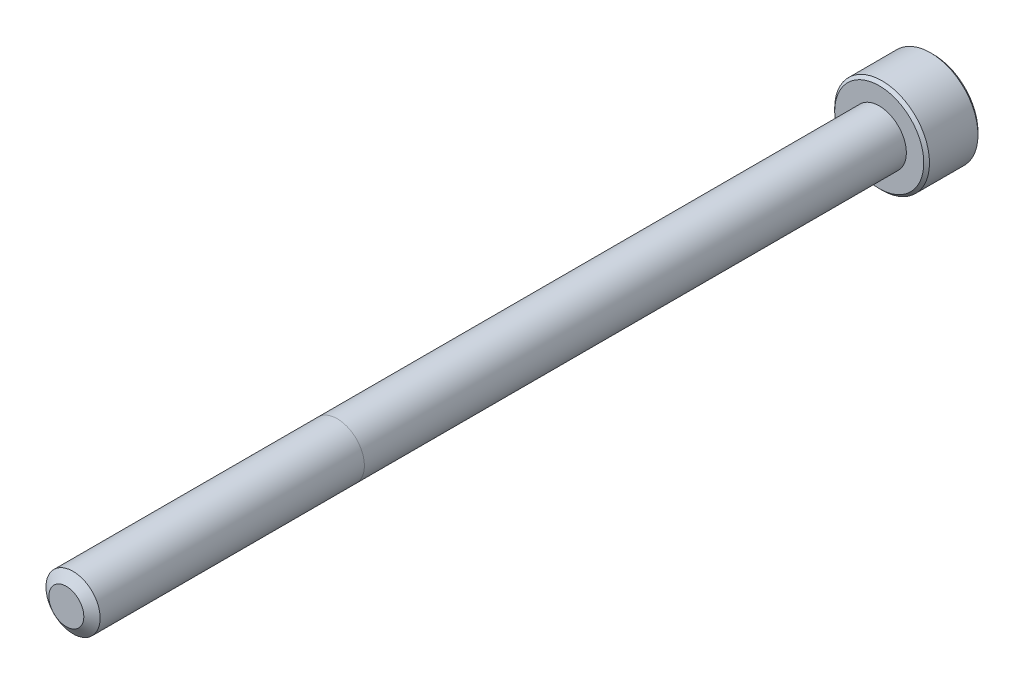
ISO-10303-21;
HEADER;
FILE_DESCRIPTION(('STEP AP214'),'2;1');
FILE_NAME('part.step','',(''),(''),'','','');
FILE_SCHEMA(('AUTOMOTIVE_DESIGN { 1 0 10303 214 1 1 1 1 }'));
ENDSEC;
DATA;
#1=APPLICATION_CONTEXT('core data for automotive mechanical design processes');
#2=APPLICATION_PROTOCOL_DEFINITION('international standard','automotive_design',2000,#1);
#3=PRODUCT_CONTEXT('',#1,'mechanical');
#4=PRODUCT('Part','Part','',(#3));
#5=PRODUCT_RELATED_PRODUCT_CATEGORY('part','',(#4));
#6=PRODUCT_DEFINITION_FORMATION('','',#4);
#7=PRODUCT_DEFINITION_CONTEXT('part definition',#1,'design');
#8=PRODUCT_DEFINITION('design','',#6,#7);
#9=PRODUCT_DEFINITION_SHAPE('','',#8);
#10=(LENGTH_UNIT() NAMED_UNIT(*) SI_UNIT(.MILLI.,.METRE.));
#11=(NAMED_UNIT(*) PLANE_ANGLE_UNIT() SI_UNIT($,.RADIAN.));
#12=(NAMED_UNIT(*) SI_UNIT($,.STERADIAN.) SOLID_ANGLE_UNIT());
#13=UNCERTAINTY_MEASURE_WITH_UNIT(LENGTH_MEASURE(1.E-05),#10,'distance_accuracy_value','');
#14=(GEOMETRIC_REPRESENTATION_CONTEXT(3) GLOBAL_UNCERTAINTY_ASSIGNED_CONTEXT((#13)) GLOBAL_UNIT_ASSIGNED_CONTEXT((#10,
#11,#12)) REPRESENTATION_CONTEXT('',''));
#15=CARTESIAN_POINT('',(0.,0.,0.));
#16=DIRECTION('',(0.,0.,1.));
#17=DIRECTION('',(1.,0.,0.));
#18=AXIS2_PLACEMENT_3D('',#15,#16,#17);
#19=CARTESIAN_POINT('',(0.,0.,-60.));
#20=DIRECTION('',(0.,0.,1.));
#21=DIRECTION('',(1.,0.,0.));
#22=AXIS2_PLACEMENT_3D('',#19,#20,#21);
#23=CYLINDRICAL_SURFACE('',#22,2.);
#24=CARTESIAN_POINT('',(0.,0.,-0.496211410611025));
#25=DIRECTION('',(0.,0.,1.));
#26=DIRECTION('',(1.,0.,0.));
#27=AXIS2_PLACEMENT_3D('',#24,#25,#26);
#28=CIRCLE('',#27,2.);
#29=CARTESIAN_POINT('',(2.,0.,-0.496211410611025));
#30=VERTEX_POINT('',#29);
#31=EDGE_CURVE('E113',#30,#30,#28,.T.);
#32=ORIENTED_EDGE('',*,*,#31,.F.);
#33=EDGE_LOOP('',(#32));
#34=FACE_BOUND('',#33,.T.);
#35=CARTESIAN_POINT('',(0.,0.,-20.));
#36=DIRECTION('',(0.,0.,-1.));
#37=DIRECTION('',(-1.,0.,0.));
#38=AXIS2_PLACEMENT_3D('',#35,#36,#37);
#39=CIRCLE('',#38,2.);
#40=CARTESIAN_POINT('',(-2.,0.,-20.));
#41=VERTEX_POINT('',#40);
#42=EDGE_CURVE('E11',#41,#41,#39,.F.);
#43=ORIENTED_EDGE('',*,*,#42,.T.);
#44=EDGE_LOOP('',(#43));
#45=FACE_BOUND('',#44,.T.);
#46=ADVANCED_FACE('F38',(#34,#45),#23,.T.);
#47=ORIENTED_EDGE('',*,*,#42,.F.);
#48=EDGE_LOOP('',(#47));
#49=FACE_BOUND('',#48,.T.);
#50=CARTESIAN_POINT('',(0.,0.,-60.));
#51=DIRECTION('',(0.,0.,-1.));
#52=DIRECTION('',(-1.,0.,0.));
#53=AXIS2_PLACEMENT_3D('',#50,#51,#52);
#54=CIRCLE('',#53,2.);
#55=CARTESIAN_POINT('',(-2.,0.,-60.));
#56=VERTEX_POINT('',#55);
#57=EDGE_CURVE('E267',#56,#56,#54,.F.);
#58=ORIENTED_EDGE('',*,*,#57,.T.);
#59=EDGE_LOOP('',(#58));
#60=FACE_BOUND('',#59,.T.);
#61=ADVANCED_FACE('F208',(#49,#60),#23,.T.);
#62=CARTESIAN_POINT('',(0.,0.,0.));
#63=DIRECTION('',(0.,0.,-1.));
#64=DIRECTION('',(-1.,0.,0.));
#65=AXIS2_PLACEMENT_3D('',#62,#63,#64);
#66=CONICAL_SURFACE('',#65,1.29133666301317,0.959931088596884);
#67=ORIENTED_EDGE('',*,*,#31,.T.);
#68=EDGE_LOOP('',(#67));
#69=FACE_BOUND('',#68,.T.);
#70=CARTESIAN_POINT('',(0.,0.,0.));
#71=DIRECTION('',(0.,0.,1.));
#72=DIRECTION('',(1.,0.,0.));
#73=AXIS2_PLACEMENT_3D('',#70,#71,#72);
#74=CIRCLE('',#73,1.29133666301317);
#75=CARTESIAN_POINT('',(1.29133666301317,0.,0.));
#76=VERTEX_POINT('',#75);
#77=EDGE_CURVE('E278',#76,#76,#74,.T.);
#78=ORIENTED_EDGE('',*,*,#77,.F.);
#79=EDGE_LOOP('',(#78));
#80=FACE_BOUND('',#79,.T.);
#81=ADVANCED_FACE('F202',(#69,#80),#66,.T.);
#82=CARTESIAN_POINT('',(0.,0.,0.));
#83=DIRECTION('',(0.,0.,1.));
#84=DIRECTION('',(1.,0.,0.));
#85=AXIS2_PLACEMENT_3D('',#82,#83,#84);
#86=PLANE('',#85);
#87=ORIENTED_EDGE('',*,*,#77,.T.);
#88=EDGE_LOOP('',(#87));
#89=FACE_BOUND('',#88,.T.);
#90=ADVANCED_FACE('F194',(#89),#86,.T.);
#91=CARTESIAN_POINT('',(0.,0.,-64.));
#92=DIRECTION('',(0.,0.,1.));
#93=DIRECTION('',(1.,0.,0.));
#94=AXIS2_PLACEMENT_3D('',#91,#92,#93);
#95=CYLINDRICAL_SURFACE('',#94,3.5);
#96=CARTESIAN_POINT('',(0.,0.,-63.79));
#97=DIRECTION('',(0.,0.,-1.));
#98=DIRECTION('',(-1.,0.,0.));
#99=AXIS2_PLACEMENT_3D('',#96,#97,#98);
#100=CIRCLE('',#99,3.5);
#101=CARTESIAN_POINT('',(3.5,0.,-63.79));
#102=VERTEX_POINT('',#101);
#103=EDGE_CURVE('E179',#102,#102,#100,.F.);
#104=CARTESIAN_POINT('',(0.,0.,-60.21));
#105=DIRECTION('',(0.,0.,-1.));
#106=DIRECTION('',(-1.,0.,0.));
#107=AXIS2_PLACEMENT_3D('',#104,#105,#106);
#108=CIRCLE('',#107,3.5);
#109=CARTESIAN_POINT('',(3.5,0.,-60.21));
#110=VERTEX_POINT('',#109);
#111=EDGE_CURVE('E176',#110,#110,#108,.T.);
#112=CARTESIAN_POINT('',(3.5,0.,-63.79));
#113=CARTESIAN_POINT('',(3.5,0.,-63.7527083333333));
#114=CARTESIAN_POINT('',(3.5,0.,-63.7154166666666));
#115=CARTESIAN_POINT('',(3.5,0.,-63.6408333333333));
#116=CARTESIAN_POINT('',(3.5,0.,-63.6035416666667));
#117=CARTESIAN_POINT('',(3.5,0.,-63.5289583333333));
#118=CARTESIAN_POINT('',(3.5,0.,-63.4916666666667));
#119=CARTESIAN_POINT('',(3.5,0.,-63.4170833333333));
#120=CARTESIAN_POINT('',(3.5,0.,-63.3797916666667));
#121=CARTESIAN_POINT('',(3.5,0.,-63.3052083333333));
#122=CARTESIAN_POINT('',(3.5,0.,-63.2679166666667));
#123=CARTESIAN_POINT('',(3.5,0.,-63.1933333333333));
#124=CARTESIAN_POINT('',(3.5,0.,-63.1560416666667));
#125=CARTESIAN_POINT('',(3.5,0.,-63.0814583333333));
#126=CARTESIAN_POINT('',(3.5,0.,-63.0441666666666));
#127=CARTESIAN_POINT('',(3.5,0.,-62.9695833333333));
#128=CARTESIAN_POINT('',(3.5,0.,-62.9322916666667));
#129=CARTESIAN_POINT('',(3.5,0.,-62.8577083333333));
#130=CARTESIAN_POINT('',(3.5,0.,-62.8204166666667));
#131=CARTESIAN_POINT('',(3.5,0.,-62.7458333333333));
#132=CARTESIAN_POINT('',(3.5,0.,-62.7085416666667));
#133=CARTESIAN_POINT('',(3.5,0.,-62.6339583333333));
#134=CARTESIAN_POINT('',(3.5,0.,-62.5966666666667));
#135=CARTESIAN_POINT('',(3.5,0.,-62.5220833333333));
#136=CARTESIAN_POINT('',(3.5,0.,-62.4847916666667));
#137=CARTESIAN_POINT('',(3.5,0.,-62.4102083333333));
#138=CARTESIAN_POINT('',(3.5,0.,-62.3729166666667));
#139=CARTESIAN_POINT('',(3.5,0.,-62.2983333333333));
#140=CARTESIAN_POINT('',(3.5,0.,-62.2610416666667));
#141=CARTESIAN_POINT('',(3.5,0.,-62.1864583333333));
#142=CARTESIAN_POINT('',(3.5,0.,-62.1491666666667));
#143=CARTESIAN_POINT('',(3.5,0.,-62.0745833333333));
#144=CARTESIAN_POINT('',(3.5,0.,-62.0372916666667));
#145=CARTESIAN_POINT('',(3.5,0.,-61.9627083333333));
#146=CARTESIAN_POINT('',(3.5,0.,-61.9254166666667));
#147=CARTESIAN_POINT('',(3.5,0.,-61.8508333333333));
#148=CARTESIAN_POINT('',(3.5,0.,-61.8135416666667));
#149=CARTESIAN_POINT('',(3.5,0.,-61.7389583333333));
#150=CARTESIAN_POINT('',(3.5,0.,-61.7016666666667));
#151=CARTESIAN_POINT('',(3.5,0.,-61.6270833333333));
#152=CARTESIAN_POINT('',(3.5,0.,-61.5897916666667));
#153=CARTESIAN_POINT('',(3.5,0.,-61.5152083333333));
#154=CARTESIAN_POINT('',(3.5,0.,-61.4779166666667));
#155=CARTESIAN_POINT('',(3.5,0.,-61.4033333333333));
#156=CARTESIAN_POINT('',(3.5,0.,-61.3660416666667));
#157=CARTESIAN_POINT('',(3.5,0.,-61.2914583333333));
#158=CARTESIAN_POINT('',(3.5,0.,-61.2541666666667));
#159=CARTESIAN_POINT('',(3.5,0.,-61.1795833333333));
#160=CARTESIAN_POINT('',(3.5,0.,-61.1422916666667));
#161=CARTESIAN_POINT('',(3.5,0.,-61.0677083333333));
#162=CARTESIAN_POINT('',(3.5,0.,-61.0304166666667));
#163=CARTESIAN_POINT('',(3.5,0.,-60.9558333333333));
#164=CARTESIAN_POINT('',(3.5,0.,-60.9185416666667));
#165=CARTESIAN_POINT('',(3.5,0.,-60.8439583333333));
#166=CARTESIAN_POINT('',(3.5,0.,-60.8066666666667));
#167=CARTESIAN_POINT('',(3.5,0.,-60.7320833333333));
#168=CARTESIAN_POINT('',(3.5,0.,-60.6947916666667));
#169=CARTESIAN_POINT('',(3.5,0.,-60.6202083333333));
#170=CARTESIAN_POINT('',(3.5,0.,-60.5829166666667));
#171=CARTESIAN_POINT('',(3.5,0.,-60.5083333333333));
#172=CARTESIAN_POINT('',(3.5,0.,-60.4710416666667));
#173=CARTESIAN_POINT('',(3.5,0.,-60.3964583333333));
#174=CARTESIAN_POINT('',(3.5,0.,-60.3591666666667));
#175=CARTESIAN_POINT('',(3.5,0.,-60.2845833333333));
#176=CARTESIAN_POINT('',(3.5,0.,-60.2472916666667));
#177=CARTESIAN_POINT('',(3.5,0.,-60.21));
#178=B_SPLINE_CURVE_WITH_KNOTS('',3,(#112,#113,#114,#115,#116,#117,#118,#119,#120,#121,#122,
#123,#124,#125,#126,#127,#128,#129,#130,#131,#132,#133,#134,#135,#136,#137,#138,#139,#140,#141,
#142,#143,#144,#145,#146,#147,#148,#149,#150,#151,#152,#153,#154,#155,#156,#157,#158,#159,#160,
#161,#162,#163,#164,#165,#166,#167,#168,#169,#170,#171,#172,#173,#174,#175,#176,#177),
.UNSPECIFIED.,.F.,.F.,(4,2,2,2,2,2,2,2,2,2,2,2,2,2,2,2,2,2,2,2,2,2,2,2,2,2,2,2,2,2,2,2,4),(0.,
0.111874999999997,0.223749999999995,0.335624999999992,0.44749999999999,0.559374999999987,
0.671249999999998,0.783124999999996,0.894999999999993,1.00687499999999,1.11874999999999,
1.230625,1.3425,1.45437499999999,1.56624999999999,1.678125,1.78999999999999,1.901875,
2.01374999999999,2.12562499999999,2.2375,2.34937499999999,2.46125,2.573125,2.68499999999999,
2.796875,2.90874999999999,3.020625,3.1325,3.24437499999999,3.35625,3.468125,3.58),.UNSPECIFIED.);
#179=EDGE_CURVE('BSEAM192',#102,#110,#178,.T.);
#180=ORIENTED_EDGE('',*,*,#103,.T.);
#181=ORIENTED_EDGE('',*,*,#111,.T.);
#182=ORIENTED_EDGE('',*,*,#179,.T.);
#183=ORIENTED_EDGE('',*,*,#179,.F.);
#184=EDGE_LOOP('',(#180,#182,#181,#183));
#185=FACE_BOUND('',#184,.T.);
#186=ADVANCED_FACE('F192',(#185),#95,.T.);
#187=CARTESIAN_POINT('',(0.,0.,-64.));
#188=DIRECTION('',(0.,0.,-1.));
#189=DIRECTION('',(-1.,0.,0.));
#190=AXIS2_PLACEMENT_3D('',#187,#188,#189);
#191=PLANE('',#190);
#192=CARTESIAN_POINT('',(0.,0.,-64.));
#193=DIRECTION('',(0.,0.,-1.));
#194=DIRECTION('',(-1.,0.,0.));
#195=AXIS2_PLACEMENT_3D('',#192,#193,#194);
#196=CIRCLE('',#195,3.28999999999999);
#197=CARTESIAN_POINT('',(3.29,0.,-64.));
#198=VERTEX_POINT('',#197);
#199=EDGE_CURVE('E112',#198,#198,#196,.T.);
#200=ORIENTED_EDGE('',*,*,#199,.T.);
#201=EDGE_LOOP('',(#200));
#202=FACE_BOUND('',#201,.T.);
#203=CARTESIAN_POINT('',(0.,0.,-64.));
#204=DIRECTION('',(0.,0.,-1.));
#205=DIRECTION('',(-1.,0.,0.));
#206=AXIS2_PLACEMENT_3D('',#203,#204,#205);
#207=CIRCLE('',#206,1.73205080756888);
#208=CARTESIAN_POINT('',(-1.5,0.866025403784445,-64.));
#209=VERTEX_POINT('',#208);
#210=CARTESIAN_POINT('',(0.,1.73205080756888,-64.));
#211=VERTEX_POINT('',#210);
#212=EDGE_CURVE('E93',#209,#211,#207,.T.);
#213=ORIENTED_EDGE('',*,*,#212,.F.);
#214=CARTESIAN_POINT('',(-1.5,-0.866025403784441,-64.));
#215=VERTEX_POINT('',#214);
#216=EDGE_CURVE('E53',#215,#209,#207,.T.);
#217=ORIENTED_EDGE('',*,*,#216,.F.);
#218=CARTESIAN_POINT('',(0.,-1.73205080756888,-64.));
#219=VERTEX_POINT('',#218);
#220=EDGE_CURVE('E435',#219,#215,#207,.T.);
#221=ORIENTED_EDGE('',*,*,#220,.F.);
#222=CARTESIAN_POINT('',(1.5,-0.866025403784442,-64.));
#223=VERTEX_POINT('',#222);
#224=EDGE_CURVE('E60',#223,#219,#207,.T.);
#225=ORIENTED_EDGE('',*,*,#224,.F.);
#226=CARTESIAN_POINT('',(1.5,0.866025403784439,-64.));
#227=VERTEX_POINT('',#226);
#228=EDGE_CURVE('E134',#227,#223,#207,.T.);
#229=ORIENTED_EDGE('',*,*,#228,.F.);
#230=EDGE_CURVE('E102',#211,#227,#207,.T.);
#231=ORIENTED_EDGE('',*,*,#230,.F.);
#232=EDGE_LOOP('',(#213,#217,#221,#225,#229,#231));
#233=FACE_BOUND('',#232,.T.);
#234=ADVANCED_FACE('F133',(#202,#233),#191,.T.);
#235=CARTESIAN_POINT('',(0.,0.,-60.));
#236=DIRECTION('',(0.,0.,-1.));
#237=DIRECTION('',(-1.,0.,0.));
#238=AXIS2_PLACEMENT_3D('',#235,#236,#237);
#239=PLANE('',#238);
#240=CARTESIAN_POINT('',(0.,0.,-60.));
#241=DIRECTION('',(0.,0.,-1.));
#242=DIRECTION('',(-1.,0.,0.));
#243=AXIS2_PLACEMENT_3D('',#240,#241,#242);
#244=CIRCLE('',#243,3.29);
#245=CARTESIAN_POINT('',(-3.29,0.,-60.));
#246=VERTEX_POINT('',#245);
#247=EDGE_CURVE('E47',#246,#246,#244,.F.);
#248=ORIENTED_EDGE('',*,*,#247,.T.);
#249=EDGE_LOOP('',(#248));
#250=FACE_BOUND('',#249,.T.);
#251=ORIENTED_EDGE('',*,*,#57,.F.);
#252=EDGE_LOOP('',(#251));
#253=FACE_BOUND('',#252,.T.);
#254=ADVANCED_FACE('F184',(#250,#253),#239,.F.);
#255=CARTESIAN_POINT('',(0.,0.,-64.));
#256=DIRECTION('',(0.,0.,-1.));
#257=DIRECTION('',(-1.,0.,0.));
#258=AXIS2_PLACEMENT_3D('',#255,#256,#257);
#259=CONICAL_SURFACE('',#258,1.73205080756888,0.78539816339745);
#260=ORIENTED_EDGE('',*,*,#230,.T.);
#261=CARTESIAN_POINT('',(-0.000199999999998786,1.73216627762271,-64.0001154816001));
#262=CARTESIAN_POINT('',(0.0513677907370791,1.70239359975915,-63.9703654760673));
#263=CARTESIAN_POINT('',(0.103797917665206,1.67212305186355,-63.9423624839103));
#264=CARTESIAN_POINT('',(0.210709034055603,1.61039789003619,-63.8910892304401));
#265=CARTESIAN_POINT('',(0.265200195814667,1.57893740312614,-63.8678475050444));
#266=CARTESIAN_POINT('',(0.375079081357255,1.51549879897987,-63.8280337289922));
#267=CARTESIAN_POINT('',(0.430438809095207,1.4835368452681,-63.8113615856709));
#268=CARTESIAN_POINT('',(0.54237725747716,1.41890915196211,-63.7856744568181));
#269=CARTESIAN_POINT('',(0.598952556553019,1.38624538781118,-63.7766402904789));
#270=CARTESIAN_POINT('',(0.696455389516452,1.32995210095299,-63.7684890812269));
#271=CARTESIAN_POINT('',(0.737256908280477,1.30639533311123,-63.7672822529892));
#272=CARTESIAN_POINT('',(0.81878796961587,1.25932335290193,-63.7693140571623));
#273=CARTESIAN_POINT('',(0.859517494314641,1.23580815085313,-63.7725536707483));
#274=CARTESIAN_POINT('',(0.940584402163428,1.18900414978426,-63.783291985982));
#275=CARTESIAN_POINT('',(0.9809213845983,1.16571558211719,-63.7907946530188));
#276=CARTESIAN_POINT('',(1.06091833691404,1.11952932016334,-63.8096516119283));
#277=CARTESIAN_POINT('',(1.10057800851622,1.09663179808786,-63.8210075570186));
#278=CARTESIAN_POINT('',(1.20216313477449,1.03798159809698,-63.8547216475927));
#279=CARTESIAN_POINT('',(1.2634585537097,1.00259267147465,-63.8796218490934));
#280=CARTESIAN_POINT('',(1.35358562846332,0.950557780604372,-63.9216566532716));
#281=CARTESIAN_POINT('',(1.38328513990772,0.933410759677145,-63.9364251535591));
#282=CARTESIAN_POINT('',(1.44213790138375,0.899432101996405,-63.9673105659402));
#283=CARTESIAN_POINT('',(1.47129140422064,0.882600319285709,-63.9834268341217));
#284=CARTESIAN_POINT('',(1.5002,0.865909933730601,-64.0001154816001));
#285=B_SPLINE_CURVE_WITH_KNOTS('',3,(#261,#262,#263,#264,#265,#266,#267,#268,#269,#270,#271,
#272,#273,#274,#275,#276,#277,#278,#279,#280,#281,#282,#283,#284),.UNSPECIFIED.,.F.,.F.,(4,2,2,
2,2,2,2,2,2,2,2,4),(0.,0.199829143693313,0.400822987382396,0.598623720538192,0.795926240188901,
0.937113067959894,1.07833105577194,1.21968061668224,1.36109089931056,1.58570969637566,
1.69770705470964,1.80965120737194),.UNSPECIFIED.);
#286=EDGE_CURVE('E107',#211,#227,#285,.T.);
#287=ORIENTED_EDGE('',*,*,#286,.F.);
#288=EDGE_LOOP('',(#260,#287));
#289=FACE_BOUND('',#288,.T.);
#290=ADVANCED_FACE('F108',(#289),#259,.F.);
#291=ORIENTED_EDGE('',*,*,#228,.T.);
#292=CARTESIAN_POINT('',(1.5,-1.72720812994823,-64.5555785164605));
#293=CARTESIAN_POINT('',(1.5,-1.68515175723693,-64.5238299080399));
#294=CARTESIAN_POINT('',(1.5,-1.64286104772391,-64.4923925939825));
#295=CARTESIAN_POINT('',(1.5,-1.55771581058238,-64.430269087717));
#296=CARTESIAN_POINT('',(1.5,-1.5148611440825,-64.3995830860455));
#297=CARTESIAN_POINT('',(1.5,-1.38468134170665,-64.3084071925586));
#298=CARTESIAN_POINT('',(1.5,-1.29637976089562,-64.2492883435437));
#299=CARTESIAN_POINT('',(1.5,-1.11121478745132,-64.1332309964035));
#300=CARTESIAN_POINT('',(1.5,-1.01415038251067,-64.0766095588047));
#301=CARTESIAN_POINT('',(1.5,-0.815173408989811,-63.9730368813091));
#302=CARTESIAN_POINT('',(1.5,-0.71327866932636,-63.9260530415721));
#303=CARTESIAN_POINT('',(1.5,-0.560333775001791,-63.8685726684515));
#304=CARTESIAN_POINT('',(1.5,-0.511547983012749,-63.8520753877783));
#305=CARTESIAN_POINT('',(1.5,-0.412798620213827,-63.8229975129476));
#306=CARTESIAN_POINT('',(1.5,-0.362834968520749,-63.8104171886138));
#307=CARTESIAN_POINT('',(1.5,-0.262863235540416,-63.7900361941635));
#308=CARTESIAN_POINT('',(1.5,-0.212872113909474,-63.7821536327604));
#309=CARTESIAN_POINT('',(1.5,-0.112355243682832,-63.7713220639777));
#310=CARTESIAN_POINT('',(1.5,-0.0618295884917316,-63.7683722085294));
#311=CARTESIAN_POINT('',(1.5,0.0374291732025491,-63.7676248577218));
#312=CARTESIAN_POINT('',(1.5,0.0861609670655345,-63.7696447335505));
#313=CARTESIAN_POINT('',(1.5,0.183206937624696,-63.7783225528794));
#314=CARTESIAN_POINT('',(1.5,0.231521073289701,-63.7849809469459));
#315=CARTESIAN_POINT('',(1.5,0.328199853268109,-63.802685244089));
#316=CARTESIAN_POINT('',(1.5,0.376550616148694,-63.8138058112177));
#317=CARTESIAN_POINT('',(1.5,0.472195696955763,-63.8398434139978));
#318=CARTESIAN_POINT('',(1.5,0.519490102919012,-63.8547601319841));
#319=CARTESIAN_POINT('',(1.5,0.668391282485067,-63.9073352235115));
#320=CARTESIAN_POINT('',(1.5,0.767878709264953,-63.9509812873618));
#321=CARTESIAN_POINT('',(1.5,0.962179866385505,-64.0480229944291));
#322=CARTESIAN_POINT('',(1.5,1.05697519927966,-64.1014536648971));
#323=CARTESIAN_POINT('',(1.5,1.23814273494589,-64.2116858517578));
#324=CARTESIAN_POINT('',(1.5,1.32469942140118,-64.2681879204262));
#325=CARTESIAN_POINT('',(1.5,1.45222331245985,-64.3555343012679));
#326=CARTESIAN_POINT('',(1.5,1.49418091932913,-64.3849577583565));
#327=CARTESIAN_POINT('',(1.5,1.5775227288333,-64.4445828214816));
#328=CARTESIAN_POINT('',(1.5,1.61890708598061,-64.4747842113029));
#329=CARTESIAN_POINT('',(1.5,1.66005277969055,-64.5053081782352));
#330=B_SPLINE_CURVE_WITH_KNOTS('',3,(#292,#293,#294,#295,#296,#297,#298,#299,#300,#301,#302,
#303,#304,#305,#306,#307,#308,#309,#310,#311,#312,#313,#314,#315,#316,#317,#318,#319,#320,#321,
#322,#323,#324,#325,#326,#327,#328,#329),.UNSPECIFIED.,.F.,.F.,(4,2,2,2,2,2,2,2,2,2,2,2,2,2,2,2,
2,2,4),(0.,0.158079549012759,0.316198781054129,0.634850417468465,0.971690311551788,
1.30737131686505,1.46173961151184,1.61611853763033,1.76772101442095,1.91929742387554,
2.06538741227089,2.21149159321504,2.36014984648186,2.50879566399377,2.83376031423512,
3.15991186974584,3.46985601780942,3.62358896013693,3.77727962610765),.UNSPECIFIED.);
#331=EDGE_CURVE('E101',#227,#223,#330,.F.);
#332=ORIENTED_EDGE('',*,*,#331,.F.);
#333=EDGE_LOOP('',(#291,#332));
#334=FACE_BOUND('',#333,.T.);
#335=ADVANCED_FACE('F312',(#334),#259,.F.);
#336=ORIENTED_EDGE('',*,*,#224,.T.);
#337=CARTESIAN_POINT('',(1.5002,-0.8659099337306,-64.0001154816001));
#338=CARTESIAN_POINT('',(1.44863220926292,-0.895682611594165,-63.9703654760673));
#339=CARTESIAN_POINT('',(1.3962020823348,-0.925953159489765,-63.9423624839103));
#340=CARTESIAN_POINT('',(1.2892909659444,-0.987678321317124,-63.8910892304401));
#341=CARTESIAN_POINT('',(1.23479980418533,-1.01913880822718,-63.8678475050444));
#342=CARTESIAN_POINT('',(1.12492091864275,-1.08257741237345,-63.8280337289922));
#343=CARTESIAN_POINT('',(1.06956119090479,-1.11453936608522,-63.8113615856709));
#344=CARTESIAN_POINT('',(0.957622742522841,-1.17916705939121,-63.7856744568181));
#345=CARTESIAN_POINT('',(0.901047443446981,-1.21183082354214,-63.7766402904789));
#346=CARTESIAN_POINT('',(0.803544610483546,-1.26812411040033,-63.7684890812269));
#347=CARTESIAN_POINT('',(0.76274309171952,-1.29168087824208,-63.7672822529892));
#348=CARTESIAN_POINT('',(0.681212030384128,-1.33875285845139,-63.7693140571623));
#349=CARTESIAN_POINT('',(0.640482505685357,-1.36226806050019,-63.7725536707483));
#350=CARTESIAN_POINT('',(0.559415597836569,-1.40907206156906,-63.783291985982));
#351=CARTESIAN_POINT('',(0.519078615401696,-1.43236062923613,-63.7907946530187));
#352=CARTESIAN_POINT('',(0.439081663085953,-1.47854689118997,-63.8096516119283));
#353=CARTESIAN_POINT('',(0.399421991483777,-1.50144441326546,-63.8210075570186));
#354=CARTESIAN_POINT('',(0.297836865225505,-1.56009461325634,-63.8547216475927));
#355=CARTESIAN_POINT('',(0.236541446290303,-1.59548353987867,-63.8796218490934));
#356=CARTESIAN_POINT('',(0.146414371536682,-1.64751843074894,-63.9216566532716));
#357=CARTESIAN_POINT('',(0.11671486009228,-1.66466545167617,-63.9364251535591));
#358=CARTESIAN_POINT('',(0.0578620986162472,-1.69864410935691,-63.9673105659402));
#359=CARTESIAN_POINT('',(0.02870859577936,-1.7154758920676,-63.9834268341217));
#360=CARTESIAN_POINT('',(-0.00020000000000291,-1.73216627762271,-64.0001154816001));
#361=B_SPLINE_CURVE_WITH_KNOTS('',3,(#337,#338,#339,#340,#341,#342,#343,#344,#345,#346,#347,
#348,#349,#350,#351,#352,#353,#354,#355,#356,#357,#358,#359,#360),.UNSPECIFIED.,.F.,.F.,(4,2,2,
2,2,2,2,2,2,2,2,4),(0.,0.199829143693309,0.400822987382397,0.59862372053819,0.795926240188903,
0.937113067959897,1.07833105577194,1.21968061668224,1.36109089931056,1.58570969637566,
1.69770705470964,1.80965120737194),.UNSPECIFIED.);
#362=EDGE_CURVE('E144',#223,#219,#361,.T.);
#363=ORIENTED_EDGE('',*,*,#362,.F.);
#364=EDGE_LOOP('',(#336,#363));
#365=FACE_BOUND('',#364,.T.);
#366=ADVANCED_FACE('F321',(#365),#259,.F.);
#367=ORIENTED_EDGE('',*,*,#220,.T.);
#368=CARTESIAN_POINT('',(0.000199999999998684,-1.73216627762271,-64.0001154816001));
#369=CARTESIAN_POINT('',(-0.0513677907370774,-1.70239359975915,-63.9703654760673));
#370=CARTESIAN_POINT('',(-0.103797917665203,-1.67212305186355,-63.9423624839103));
#371=CARTESIAN_POINT('',(-0.210709034055601,-1.61039789003619,-63.8910892304401));
#372=CARTESIAN_POINT('',(-0.265200195814666,-1.57893740312614,-63.8678475050444));
#373=CARTESIAN_POINT('',(-0.375079081357254,-1.51549879897987,-63.8280337289922));
#374=CARTESIAN_POINT('',(-0.430438809095205,-1.4835368452681,-63.8113615856709));
#375=CARTESIAN_POINT('',(-0.542377257477158,-1.41890915196211,-63.7856744568181));
#376=CARTESIAN_POINT('',(-0.598952556553018,-1.38624538781118,-63.7766402904789));
#377=CARTESIAN_POINT('',(-0.696455389516452,-1.32995210095299,-63.7684890812269));
#378=CARTESIAN_POINT('',(-0.737256908280478,-1.30639533311123,-63.7672822529892));
#379=CARTESIAN_POINT('',(-0.81878796961587,-1.25932335290193,-63.7693140571623));
#380=CARTESIAN_POINT('',(-0.859517494314641,-1.23580815085313,-63.7725536707483));
#381=CARTESIAN_POINT('',(-0.940584402163428,-1.18900414978426,-63.783291985982));
#382=CARTESIAN_POINT('',(-0.980921384598301,-1.16571558211719,-63.7907946530188));
#383=CARTESIAN_POINT('',(-1.06091833691404,-1.11952932016334,-63.8096516119283));
#384=CARTESIAN_POINT('',(-1.10057800851622,-1.09663179808786,-63.8210075570186));
#385=CARTESIAN_POINT('',(-1.20216313477449,-1.03798159809698,-63.8547216475927));
#386=CARTESIAN_POINT('',(-1.2634585537097,-1.00259267147465,-63.8796218490934));
#387=CARTESIAN_POINT('',(-1.35358562846332,-0.950557780604372,-63.9216566532716));
#388=CARTESIAN_POINT('',(-1.38328513990772,-0.933410759677145,-63.9364251535591));
#389=CARTESIAN_POINT('',(-1.44213790138375,-0.899432101996406,-63.9673105659402));
#390=CARTESIAN_POINT('',(-1.47129140422064,-0.88260031928571,-63.9834268341217));
#391=CARTESIAN_POINT('',(-1.5002,-0.865909933730603,-64.0001154816001));
#392=B_SPLINE_CURVE_WITH_KNOTS('',3,(#368,#369,#370,#371,#372,#373,#374,#375,#376,#377,#378,
#379,#380,#381,#382,#383,#384,#385,#386,#387,#388,#389,#390,#391),.UNSPECIFIED.,.F.,.F.,(4,2,2,
2,2,2,2,2,2,2,2,4),(0.,0.199829143693309,0.400822987382396,0.598623720538189,0.795926240188901,
0.937113067959894,1.07833105577194,1.21968061668224,1.36109089931056,1.58570969637566,
1.69770705470964,1.80965120737193),.UNSPECIFIED.);
#393=EDGE_CURVE('E243',#219,#215,#392,.T.);
#394=ORIENTED_EDGE('',*,*,#393,.F.);
#395=EDGE_LOOP('',(#367,#394));
#396=FACE_BOUND('',#395,.T.);
#397=ADVANCED_FACE('F330',(#396),#259,.F.);
#398=ORIENTED_EDGE('',*,*,#216,.T.);
#399=CARTESIAN_POINT('',(-1.5,-1.72720812969693,-64.5555785162708));
#400=CARTESIAN_POINT('',(-1.5,-1.68515175699268,-64.5238299078574));
#401=CARTESIAN_POINT('',(-1.5,-1.64286104748674,-64.4923925938074));
#402=CARTESIAN_POINT('',(-1.5,-1.55771581035942,-64.4302690875564));
#403=CARTESIAN_POINT('',(-1.5,-1.51486114386669,-64.3995830858922));
#404=CARTESIAN_POINT('',(-1.5,-1.38468134151271,-64.3084071924272));
#405=CARTESIAN_POINT('',(-1.5,-1.29637976071654,-64.2492883434268));
#406=CARTESIAN_POINT('',(-1.5,-1.11121478730468,-64.1332309963165));
#407=CARTESIAN_POINT('',(-1.5,-1.01415038238168,-64.076609558733));
#408=CARTESIAN_POINT('',(-1.5,-0.815173408897612,-63.9730368812657));
#409=CARTESIAN_POINT('',(-1.5,-0.713278669253292,-63.9260530415417));
#410=CARTESIAN_POINT('',(-1.5,-0.560333774943118,-63.8685726684308));
#411=CARTESIAN_POINT('',(-1.5,-0.511547982948047,-63.8520753877573));
#412=CARTESIAN_POINT('',(-1.5,-0.41279862013687,-63.822997512927));
#413=CARTESIAN_POINT('',(-1.5,-0.362834968437567,-63.810417188594));
#414=CARTESIAN_POINT('',(-1.5,-0.262863235444987,-63.7900361941468));
#415=CARTESIAN_POINT('',(-1.5,-0.212872113808028,-63.782153632746));
#416=CARTESIAN_POINT('',(-1.5,-0.112355243569553,-63.771322063969));
#417=CARTESIAN_POINT('',(-1.5,-0.0618295883726361,-63.7683722085243));
#418=CARTESIAN_POINT('',(-1.5,0.0374291733323752,-63.7676248577248));
#419=CARTESIAN_POINT('',(-1.5,0.0861609672002903,-63.7696447335581));
#420=CARTESIAN_POINT('',(-1.5,0.183206937768819,-63.7783225528968));
#421=CARTESIAN_POINT('',(-1.5,0.231521073438261,-63.7849809469685));
#422=CARTESIAN_POINT('',(-1.5,0.328199853425427,-63.8026852441226));
#423=CARTESIAN_POINT('',(-1.5,0.376550616310319,-63.813805811257));
#424=CARTESIAN_POINT('',(-1.5,0.472195697125589,-63.8398434140487));
#425=CARTESIAN_POINT('',(-1.5,0.519490103092732,-63.8547601320409));
#426=CARTESIAN_POINT('',(-1.5,0.668391282696614,-63.9073352235961));
#427=CARTESIAN_POINT('',(-1.5,0.767878709508541,-63.950981287472));
#428=CARTESIAN_POINT('',(-1.5,0.962179866690712,-64.0480229945931));
#429=CARTESIAN_POINT('',(-1.5,1.05697519961443,-64.1014536650895));
#430=CARTESIAN_POINT('',(-1.5,1.23814273533382,-64.2116858520045));
#431=CARTESIAN_POINT('',(-1.5,1.32469942181289,-64.2681879206986));
#432=CARTESIAN_POINT('',(-1.5,1.45222331290672,-64.3555343015786));
#433=CARTESIAN_POINT('',(-1.5,1.49418091978754,-64.38495775868));
#434=CARTESIAN_POINT('',(-1.5,1.57752272931474,-64.4445828218305));
#435=CARTESIAN_POINT('',(-1.5,1.61890708647352,-64.4747842116644));
#436=CARTESIAN_POINT('',(-1.5,1.66005278019492,-64.5053081786094));
#437=B_SPLINE_CURVE_WITH_KNOTS('',3,(#399,#400,#401,#402,#403,#404,#405,#406,#407,#408,#409,
#410,#411,#412,#413,#414,#415,#416,#417,#418,#419,#420,#421,#422,#423,#424,#425,#426,#427,#428,
#429,#430,#431,#432,#433,#434,#435,#436),.UNSPECIFIED.,.F.,.F.,(4,2,2,2,2,2,2,2,2,2,2,2,2,2,2,2,
2,2,4),(0.,0.158079548982664,0.316198780993941,0.63485041734695,0.971690311361504,
1.30737131660667,1.46173961127089,1.61611853740677,1.76772101421409,1.91929742368538,
2.065387412096,2.21149159305544,2.36014984633872,2.50879566386709,2.83376031422672,
3.15991186985651,3.46985601802196,3.62358896039972,3.77727962642069),.UNSPECIFIED.);
#438=EDGE_CURVE('E123',#215,#209,#437,.T.);
#439=ORIENTED_EDGE('',*,*,#438,.F.);
#440=EDGE_LOOP('',(#398,#439));
#441=FACE_BOUND('',#440,.T.);
#442=ADVANCED_FACE('F338',(#441),#259,.F.);
#443=ORIENTED_EDGE('',*,*,#212,.T.);
#444=CARTESIAN_POINT('',(-1.5002,0.865909933730602,-64.0001154816001));
#445=CARTESIAN_POINT('',(-1.44863220926292,0.895682611594168,-63.9703654760673));
#446=CARTESIAN_POINT('',(-1.39620208233479,0.925953159489768,-63.9423624839103));
#447=CARTESIAN_POINT('',(-1.2892909659444,0.987678321317127,-63.8910892304401));
#448=CARTESIAN_POINT('',(-1.23479980418533,1.01913880822718,-63.8678475050444));
#449=CARTESIAN_POINT('',(-1.12492091864274,1.08257741237345,-63.8280337289922));
#450=CARTESIAN_POINT('',(-1.06956119090479,1.11453936608522,-63.8113615856709));
#451=CARTESIAN_POINT('',(-0.95762274252284,1.17916705939121,-63.7856744568181));
#452=CARTESIAN_POINT('',(-0.90104744344698,1.21183082354214,-63.7766402904789));
#453=CARTESIAN_POINT('',(-0.803544610483546,1.26812411040033,-63.7684890812269));
#454=CARTESIAN_POINT('',(-0.76274309171952,1.29168087824208,-63.7672822529892));
#455=CARTESIAN_POINT('',(-0.681212030384128,1.33875285845139,-63.7693140571623));
#456=CARTESIAN_POINT('',(-0.640482505685356,1.36226806050019,-63.7725536707483));
#457=CARTESIAN_POINT('',(-0.559415597836569,1.40907206156906,-63.783291985982));
#458=CARTESIAN_POINT('',(-0.519078615401697,1.43236062923613,-63.7907946530188));
#459=CARTESIAN_POINT('',(-0.439081663085954,1.47854689118997,-63.8096516119283));
#460=CARTESIAN_POINT('',(-0.399421991483777,1.50144441326546,-63.8210075570186));
#461=CARTESIAN_POINT('',(-0.297836865225503,1.56009461325634,-63.8547216475927));
#462=CARTESIAN_POINT('',(-0.2365414462903,1.59548353987867,-63.8796218490934));
#463=CARTESIAN_POINT('',(-0.14641437153668,1.64751843074894,-63.9216566532716));
#464=CARTESIAN_POINT('',(-0.116714860092278,1.66466545167617,-63.9364251535591));
#465=CARTESIAN_POINT('',(-0.0578620986162471,1.69864410935691,-63.9673105659402));
#466=CARTESIAN_POINT('',(-0.0287085957793604,1.71547589206761,-63.9834268341217));
#467=CARTESIAN_POINT('',(0.000200000000001939,1.73216627762271,-64.0001154816001));
#468=B_SPLINE_CURVE_WITH_KNOTS('',3,(#444,#445,#446,#447,#448,#449,#450,#451,#452,#453,#454,
#455,#456,#457,#458,#459,#460,#461,#462,#463,#464,#465,#466,#467),.UNSPECIFIED.,.F.,.F.,(4,2,2,
2,2,2,2,2,2,2,2,4),(0.,0.199829143693312,0.400822987382395,0.598623720538189,0.795926240188902,
0.937113067959895,1.07833105577194,1.21968061668224,1.36109089931056,1.58570969637566,
1.69770705470963,1.80965120737194),.UNSPECIFIED.);
#469=EDGE_CURVE('E97',#209,#211,#468,.T.);
#470=ORIENTED_EDGE('',*,*,#469,.F.);
#471=EDGE_LOOP('',(#443,#470));
#472=FACE_BOUND('',#471,.T.);
#473=ADVANCED_FACE('F95',(#472),#259,.F.);
#474=CARTESIAN_POINT('',(-1.5,0.86602540378444,-61.75));
#475=DIRECTION('',(0.,0.,1.));
#476=DIRECTION('',(1.,0.,0.));
#477=AXIS2_PLACEMENT_3D('',#474,#475,#476);
#478=PLANE('',#477);
#479=DIRECTION('',(0.866025403784439,0.5,0.));
#480=VECTOR('',#479,1.);
#481=CARTESIAN_POINT('',(-1.5,0.86602540378444,-61.75));
#482=LINE('',#481,#480);
#483=CARTESIAN_POINT('',(-1.5,0.86602540378444,-61.75));
#484=VERTEX_POINT('',#483);
#485=CARTESIAN_POINT('',(0.,1.73205080756888,-61.75));
#486=VERTEX_POINT('',#485);
#487=EDGE_CURVE('E122',#484,#486,#482,.T.);
#488=ORIENTED_EDGE('',*,*,#487,.T.);
#489=DIRECTION('',(0.866025403784439,-0.5,0.));
#490=VECTOR('',#489,1.);
#491=CARTESIAN_POINT('',(0.,1.73205080756888,-61.75));
#492=LINE('',#491,#490);
#493=CARTESIAN_POINT('',(1.5,0.86602540378444,-61.75));
#494=VERTEX_POINT('',#493);
#495=EDGE_CURVE('E127',#486,#494,#492,.T.);
#496=ORIENTED_EDGE('',*,*,#495,.T.);
#497=DIRECTION('',(0.,-1.,0.));
#498=VECTOR('',#497,1.);
#499=CARTESIAN_POINT('',(1.5,0.86602540378444,-61.75));
#500=LINE('',#499,#498);
#501=CARTESIAN_POINT('',(1.5,-0.866025403784438,-61.75));
#502=VERTEX_POINT('',#501);
#503=EDGE_CURVE('E255',#494,#502,#500,.T.);
#504=ORIENTED_EDGE('',*,*,#503,.T.);
#505=DIRECTION('',(-0.866025403784439,-0.5,0.));
#506=VECTOR('',#505,1.);
#507=CARTESIAN_POINT('',(1.5,-0.866025403784438,-61.75));
#508=LINE('',#507,#506);
#509=CARTESIAN_POINT('',(0.,-1.73205080756888,-61.75));
#510=VERTEX_POINT('',#509);
#511=EDGE_CURVE('E258',#502,#510,#508,.T.);
#512=ORIENTED_EDGE('',*,*,#511,.T.);
#513=DIRECTION('',(-0.866025403784439,0.5,0.));
#514=VECTOR('',#513,1.);
#515=CARTESIAN_POINT('',(0.,-1.73205080756888,-61.75));
#516=LINE('',#515,#514);
#517=CARTESIAN_POINT('',(-1.5,-0.866025403784441,-61.75));
#518=VERTEX_POINT('',#517);
#519=EDGE_CURVE('E261',#510,#518,#516,.T.);
#520=ORIENTED_EDGE('',*,*,#519,.T.);
#521=DIRECTION('',(0.,1.,0.));
#522=VECTOR('',#521,1.);
#523=CARTESIAN_POINT('',(-1.5,-0.866025403784441,-61.75));
#524=LINE('',#523,#522);
#525=EDGE_CURVE('E130',#518,#484,#524,.T.);
#526=ORIENTED_EDGE('',*,*,#525,.T.);
#527=EDGE_LOOP('',(#488,#496,#504,#512,#520,#526));
#528=FACE_BOUND('',#527,.T.);
#529=ADVANCED_FACE('F164',(#528),#478,.F.);
#530=CARTESIAN_POINT('',(0.,1.73205080756888,-61.75));
#531=DIRECTION('',(0.5,0.866025403784439,0.));
#532=DIRECTION('',(-0.866025403784439,0.5,0.));
#533=AXIS2_PLACEMENT_3D('',#530,#531,#532);
#534=PLANE('',#533);
#535=DIRECTION('',(0.,0.,-1.));
#536=VECTOR('',#535,1.);
#537=CARTESIAN_POINT('',(0.,1.73205080756888,-61.75));
#538=LINE('',#537,#536);
#539=EDGE_CURVE('E119',#486,#211,#538,.T.);
#540=ORIENTED_EDGE('',*,*,#539,.T.);
#541=ORIENTED_EDGE('',*,*,#286,.T.);
#542=DIRECTION('',(0.,0.,-1.));
#543=VECTOR('',#542,1.);
#544=CARTESIAN_POINT('',(1.5,0.86602540378444,-61.75));
#545=LINE('',#544,#543);
#546=EDGE_CURVE('E129',#494,#227,#545,.T.);
#547=ORIENTED_EDGE('',*,*,#546,.F.);
#548=ORIENTED_EDGE('',*,*,#495,.F.);
#549=EDGE_LOOP('',(#540,#541,#547,#548));
#550=FACE_BOUND('',#549,.T.);
#551=ADVANCED_FACE('F125',(#550),#534,.F.);
#552=CARTESIAN_POINT('',(1.5,0.86602540378444,-61.75));
#553=DIRECTION('',(1.,0.,0.));
#554=DIRECTION('',(0.,1.,0.));
#555=AXIS2_PLACEMENT_3D('',#552,#553,#554);
#556=PLANE('',#555);
#557=ORIENTED_EDGE('',*,*,#546,.T.);
#558=ORIENTED_EDGE('',*,*,#331,.T.);
#559=DIRECTION('',(0.,0.,-1.));
#560=VECTOR('',#559,1.);
#561=CARTESIAN_POINT('',(1.5,-0.866025403784438,-61.75));
#562=LINE('',#561,#560);
#563=EDGE_CURVE('E273',#502,#223,#562,.T.);
#564=ORIENTED_EDGE('',*,*,#563,.F.);
#565=ORIENTED_EDGE('',*,*,#503,.F.);
#566=EDGE_LOOP('',(#557,#558,#564,#565));
#567=FACE_BOUND('',#566,.T.);
#568=ADVANCED_FACE('F153',(#567),#556,.F.);
#569=CARTESIAN_POINT('',(1.5,-0.866025403784438,-61.75));
#570=DIRECTION('',(0.5,-0.866025403784439,0.));
#571=DIRECTION('',(0.866025403784439,0.5,0.));
#572=AXIS2_PLACEMENT_3D('',#569,#570,#571);
#573=PLANE('',#572);
#574=ORIENTED_EDGE('',*,*,#563,.T.);
#575=ORIENTED_EDGE('',*,*,#362,.T.);
#576=DIRECTION('',(0.,0.,-1.));
#577=VECTOR('',#576,1.);
#578=CARTESIAN_POINT('',(0.,-1.73205080756888,-61.75));
#579=LINE('',#578,#577);
#580=EDGE_CURVE('E270',#510,#219,#579,.T.);
#581=ORIENTED_EDGE('',*,*,#580,.F.);
#582=ORIENTED_EDGE('',*,*,#511,.F.);
#583=EDGE_LOOP('',(#574,#575,#581,#582));
#584=FACE_BOUND('',#583,.T.);
#585=ADVANCED_FACE('F157',(#584),#573,.F.);
#586=CARTESIAN_POINT('',(0.,-1.73205080756888,-61.75));
#587=DIRECTION('',(-0.5,-0.866025403784439,0.));
#588=DIRECTION('',(0.866025403784439,-0.5,0.));
#589=AXIS2_PLACEMENT_3D('',#586,#587,#588);
#590=PLANE('',#589);
#591=ORIENTED_EDGE('',*,*,#580,.T.);
#592=ORIENTED_EDGE('',*,*,#393,.T.);
#593=DIRECTION('',(0.,0.,-1.));
#594=VECTOR('',#593,1.);
#595=CARTESIAN_POINT('',(-1.5,-0.866025403784441,-61.75));
#596=LINE('',#595,#594);
#597=EDGE_CURVE('E268',#518,#215,#596,.T.);
#598=ORIENTED_EDGE('',*,*,#597,.F.);
#599=ORIENTED_EDGE('',*,*,#519,.F.);
#600=EDGE_LOOP('',(#591,#592,#598,#599));
#601=FACE_BOUND('',#600,.T.);
#602=ADVANCED_FACE('F229',(#601),#590,.F.);
#603=CARTESIAN_POINT('',(-1.5,-0.866025403784441,-61.75));
#604=DIRECTION('',(-1.,0.,0.));
#605=DIRECTION('',(0.,0.,1.));
#606=AXIS2_PLACEMENT_3D('',#603,#604,#605);
#607=PLANE('',#606);
#608=ORIENTED_EDGE('',*,*,#597,.T.);
#609=ORIENTED_EDGE('',*,*,#438,.T.);
#610=DIRECTION('',(0.,0.,-1.));
#611=VECTOR('',#610,1.);
#612=CARTESIAN_POINT('',(-1.5,0.86602540378444,-61.75));
#613=LINE('',#612,#611);
#614=EDGE_CURVE('E121',#484,#209,#613,.T.);
#615=ORIENTED_EDGE('',*,*,#614,.F.);
#616=ORIENTED_EDGE('',*,*,#525,.F.);
#617=EDGE_LOOP('',(#608,#609,#615,#616));
#618=FACE_BOUND('',#617,.T.);
#619=ADVANCED_FACE('F222',(#618),#607,.F.);
#620=CARTESIAN_POINT('',(-1.5,0.86602540378444,-61.75));
#621=DIRECTION('',(-0.5,0.866025403784439,0.));
#622=DIRECTION('',(-0.866025403784439,-0.5,0.));
#623=AXIS2_PLACEMENT_3D('',#620,#621,#622);
#624=PLANE('',#623);
#625=ORIENTED_EDGE('',*,*,#614,.T.);
#626=ORIENTED_EDGE('',*,*,#469,.T.);
#627=ORIENTED_EDGE('',*,*,#539,.F.);
#628=ORIENTED_EDGE('',*,*,#487,.F.);
#629=EDGE_LOOP('',(#625,#626,#627,#628));
#630=FACE_BOUND('',#629,.T.);
#631=ADVANCED_FACE('F117',(#630),#624,.F.);
#632=CARTESIAN_POINT('',(0.,0.,-64.));
#633=DIRECTION('',(0.,0.,1.));
#634=DIRECTION('',(1.,0.,0.));
#635=AXIS2_PLACEMENT_3D('',#632,#633,#634);
#636=CONICAL_SURFACE('',#635,3.28999999999999,0.785398163397458);
#637=CARTESIAN_POINT('',(3.50000000000001,0.,-63.79));
#638=CARTESIAN_POINT('',(3.4978125,0.,-63.7921875));
#639=CARTESIAN_POINT('',(3.495625,0.,-63.794375));
#640=CARTESIAN_POINT('',(3.49125000000001,0.,-63.79875));
#641=CARTESIAN_POINT('',(3.48906250000001,0.,-63.8009375));
#642=CARTESIAN_POINT('',(3.48468750000001,0.,-63.8053125));
#643=CARTESIAN_POINT('',(3.48250000000001,0.,-63.8075));
#644=CARTESIAN_POINT('',(3.47812500000001,0.,-63.811875));
#645=CARTESIAN_POINT('',(3.47593750000001,0.,-63.8140625));
#646=CARTESIAN_POINT('',(3.47156250000001,0.,-63.8184375));
#647=CARTESIAN_POINT('',(3.46937500000001,0.,-63.820625));
#648=CARTESIAN_POINT('',(3.46500000000001,0.,-63.825));
#649=CARTESIAN_POINT('',(3.46281250000001,0.,-63.8271875));
#650=CARTESIAN_POINT('',(3.45843750000001,0.,-63.8315625));
#651=CARTESIAN_POINT('',(3.45625000000001,0.,-63.83375));
#652=CARTESIAN_POINT('',(3.45187500000001,0.,-63.838125));
#653=CARTESIAN_POINT('',(3.44968750000001,0.,-63.8403125));
#654=CARTESIAN_POINT('',(3.4453125,0.,-63.8446875));
#655=CARTESIAN_POINT('',(3.443125,0.,-63.846875));
#656=CARTESIAN_POINT('',(3.43875000000001,0.,-63.85125));
#657=CARTESIAN_POINT('',(3.43656250000001,0.,-63.8534375));
#658=CARTESIAN_POINT('',(3.43218750000001,0.,-63.8578125));
#659=CARTESIAN_POINT('',(3.43,0.,-63.86));
#660=CARTESIAN_POINT('',(3.425625,0.,-63.864375));
#661=CARTESIAN_POINT('',(3.4234375,0.,-63.8665625));
#662=CARTESIAN_POINT('',(3.4190625,0.,-63.8709375));
#663=CARTESIAN_POINT('',(3.416875,0.,-63.873125));
#664=CARTESIAN_POINT('',(3.4125,0.,-63.8775));
#665=CARTESIAN_POINT('',(3.4103125,0.,-63.8796875));
#666=CARTESIAN_POINT('',(3.4059375,0.,-63.8840625));
#667=CARTESIAN_POINT('',(3.40375,0.,-63.88625));
#668=CARTESIAN_POINT('',(3.399375,0.,-63.890625));
#669=CARTESIAN_POINT('',(3.3971875,0.,-63.8928125));
#670=CARTESIAN_POINT('',(3.3928125,0.,-63.8971875));
#671=CARTESIAN_POINT('',(3.390625,0.,-63.899375));
#672=CARTESIAN_POINT('',(3.38625,0.,-63.90375));
#673=CARTESIAN_POINT('',(3.3840625,0.,-63.9059375));
#674=CARTESIAN_POINT('',(3.3796875,0.,-63.9103125));
#675=CARTESIAN_POINT('',(3.3775,0.,-63.9125));
#676=CARTESIAN_POINT('',(3.373125,0.,-63.916875));
#677=CARTESIAN_POINT('',(3.3709375,0.,-63.9190625));
#678=CARTESIAN_POINT('',(3.3665625,0.,-63.9234375));
#679=CARTESIAN_POINT('',(3.364375,0.,-63.925625));
#680=CARTESIAN_POINT('',(3.36,0.,-63.93));
#681=CARTESIAN_POINT('',(3.3578125,0.,-63.9321875));
#682=CARTESIAN_POINT('',(3.3534375,0.,-63.9365625));
#683=CARTESIAN_POINT('',(3.35125,0.,-63.93875));
#684=CARTESIAN_POINT('',(3.346875,0.,-63.943125));
#685=CARTESIAN_POINT('',(3.3446875,0.,-63.9453125));
#686=CARTESIAN_POINT('',(3.3403125,0.,-63.9496875));
#687=CARTESIAN_POINT('',(3.338125,0.,-63.951875));
#688=CARTESIAN_POINT('',(3.33375,0.,-63.95625));
#689=CARTESIAN_POINT('',(3.3315625,0.,-63.9584375));
#690=CARTESIAN_POINT('',(3.3271875,0.,-63.9628125));
#691=CARTESIAN_POINT('',(3.325,0.,-63.965));
#692=CARTESIAN_POINT('',(3.320625,0.,-63.969375));
#693=CARTESIAN_POINT('',(3.3184375,0.,-63.9715625));
#694=CARTESIAN_POINT('',(3.3140625,0.,-63.9759375));
#695=CARTESIAN_POINT('',(3.311875,0.,-63.978125));
#696=CARTESIAN_POINT('',(3.3075,0.,-63.9825));
#697=CARTESIAN_POINT('',(3.3053125,0.,-63.9846875));
#698=CARTESIAN_POINT('',(3.3009375,0.,-63.9890625));
#699=CARTESIAN_POINT('',(3.29875,0.,-63.99125));
#700=CARTESIAN_POINT('',(3.294375,0.,-63.995625));
#701=CARTESIAN_POINT('',(3.2921875,0.,-63.9978125));
#702=CARTESIAN_POINT('',(3.29,0.,-64.));
#703=B_SPLINE_CURVE_WITH_KNOTS('',3,(#637,#638,#639,#640,#641,#642,#643,#644,#645,#646,#647,
#648,#649,#650,#651,#652,#653,#654,#655,#656,#657,#658,#659,#660,#661,#662,#663,#664,#665,#666,
#667,#668,#669,#670,#671,#672,#673,#674,#675,#676,#677,#678,#679,#680,#681,#682,#683,#684,#685,
#686,#687,#688,#689,#690,#691,#692,#693,#694,#695,#696,#697,#698,#699,#700,#701,#702),
.UNSPECIFIED.,.F.,.F.,(4,2,2,2,2,2,2,2,2,2,2,2,2,2,2,2,2,2,2,2,2,2,2,2,2,2,2,2,2,2,2,2,4),(0.,
0.00928077650306463,0.0185615530061394,0.0278423295092138,0.0371231060122882,0.0464038825153627,
0.0556846590184374,0.0649654355215119,0.0742462120245863,0.0835269885276611,0.0928077650307355,
0.1020885415338,0.111369318036875,0.120650094539949,0.129930871043024,0.139211647546098,
0.148492424049173,0.157773200552247,0.167053977055322,0.176334753558396,0.185615530061471,
0.194896306564545,0.20417708306761,0.213457859570684,0.222738636073759,0.232019412576834,
0.241300189079908,0.250580965582983,0.259861742086057,0.269142518589132,0.278423295092206,
0.287704071595281,0.296984848098355),.UNSPECIFIED.);
#704=EDGE_CURVE('BSEAM189',#102,#198,#703,.T.);
#705=ORIENTED_EDGE('',*,*,#103,.F.);
#706=ORIENTED_EDGE('',*,*,#199,.F.);
#707=ORIENTED_EDGE('',*,*,#704,.T.);
#708=ORIENTED_EDGE('',*,*,#704,.F.);
#709=EDGE_LOOP('',(#705,#707,#706,#708));
#710=FACE_BOUND('',#709,.T.);
#711=ADVANCED_FACE('F189',(#710),#636,.T.);
#712=CARTESIAN_POINT('',(0.,0.,-60.21));
#713=DIRECTION('',(0.,0.,-1.));
#714=DIRECTION('',(-1.,0.,0.));
#715=AXIS2_PLACEMENT_3D('',#712,#713,#714);
#716=CONICAL_SURFACE('',#715,3.5,0.785398163397457);
#717=ORIENTED_EDGE('',*,*,#247,.F.);
#718=EDGE_LOOP('',(#717));
#719=FACE_BOUND('',#718,.T.);
#720=ORIENTED_EDGE('',*,*,#111,.F.);
#721=EDGE_LOOP('',(#720));
#722=FACE_BOUND('',#721,.T.);
#723=ADVANCED_FACE('F40',(#719,#722),#716,.T.);
#724=CLOSED_SHELL('',(#46,#61,#81,#90,#186,#234,#254,#290,#335,#366,#397,#442,#473,#529,#551,
#568,#585,#602,#619,#631,#711,#723));
#725=MANIFOLD_SOLID_BREP('B2',#724);
#726=ADVANCED_BREP_SHAPE_REPRESENTATION('',(#18,#725),#14);
#727=SHAPE_DEFINITION_REPRESENTATION(#9,#726);
ENDSEC;
END-ISO-10303-21;
